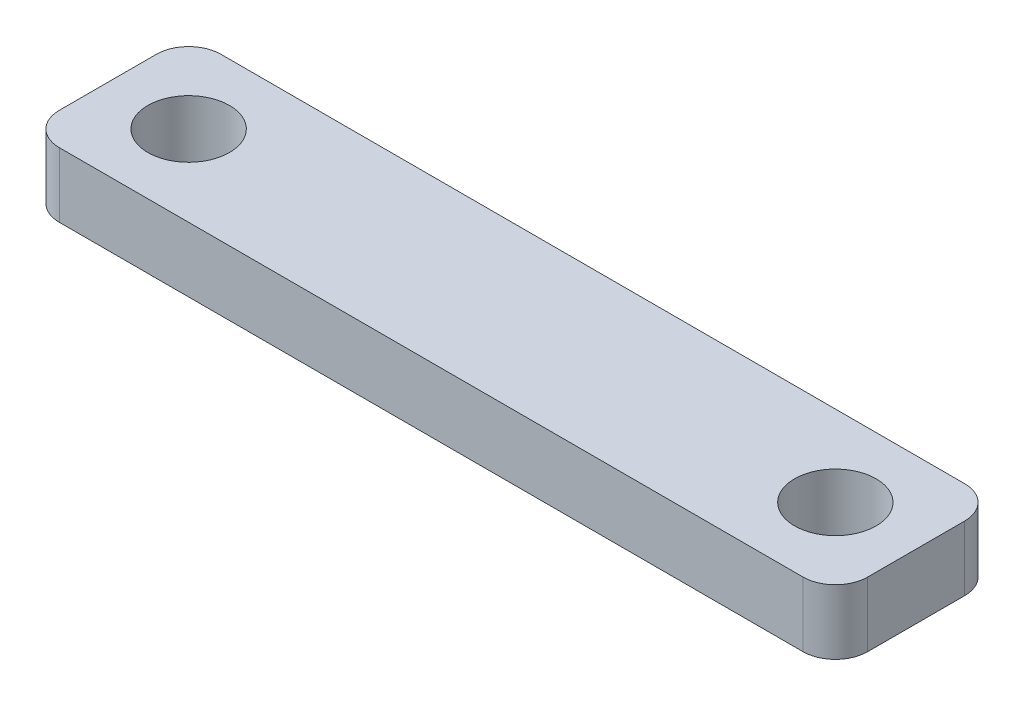
ISO-10303-21;
HEADER;
FILE_DESCRIPTION(('STEP AP214'),'2;1');
FILE_NAME('part.step','',(''),(''),'','','');
FILE_SCHEMA(('AUTOMOTIVE_DESIGN { 1 0 10303 214 1 1 1 1 }'));
ENDSEC;
DATA;
#1=APPLICATION_CONTEXT('core data for automotive mechanical design processes');
#2=APPLICATION_PROTOCOL_DEFINITION('international standard','automotive_design',2000,#1);
#3=PRODUCT_CONTEXT('',#1,'mechanical');
#4=PRODUCT('Part','Part','',(#3));
#5=PRODUCT_RELATED_PRODUCT_CATEGORY('part','',(#4));
#6=PRODUCT_DEFINITION_FORMATION('','',#4);
#7=PRODUCT_DEFINITION_CONTEXT('part definition',#1,'design');
#8=PRODUCT_DEFINITION('design','',#6,#7);
#9=PRODUCT_DEFINITION_SHAPE('','',#8);
#10=(LENGTH_UNIT() NAMED_UNIT(*) SI_UNIT(.MILLI.,.METRE.));
#11=(NAMED_UNIT(*) PLANE_ANGLE_UNIT() SI_UNIT($,.RADIAN.));
#12=(NAMED_UNIT(*) SI_UNIT($,.STERADIAN.) SOLID_ANGLE_UNIT());
#13=UNCERTAINTY_MEASURE_WITH_UNIT(LENGTH_MEASURE(1.E-05),#10,'distance_accuracy_value','');
#14=(GEOMETRIC_REPRESENTATION_CONTEXT(3) GLOBAL_UNCERTAINTY_ASSIGNED_CONTEXT((#13)) GLOBAL_UNIT_ASSIGNED_CONTEXT((#10,
#11,#12)) REPRESENTATION_CONTEXT('',''));
#15=CARTESIAN_POINT('',(0.,0.,0.));
#16=DIRECTION('',(0.,0.,1.));
#17=DIRECTION('',(1.,0.,0.));
#18=AXIS2_PLACEMENT_3D('',#15,#16,#17);
#19=CARTESIAN_POINT('',(0.,4.,0.));
#20=DIRECTION('',(0.,-1.,0.));
#21=DIRECTION('',(0.,0.,1.));
#22=AXIS2_PLACEMENT_3D('',#19,#20,#21);
#23=PLANE('',#22);
#24=DIRECTION('',(0.,0.,1.));
#25=VECTOR('',#24,1.);
#26=CARTESIAN_POINT('',(5.,4.,-5.));
#27=LINE('',#26,#25);
#28=CARTESIAN_POINT('',(5.,4.,-3.));
#29=VERTEX_POINT('',#28);
#30=CARTESIAN_POINT('',(5.,4.,3.));
#31=VERTEX_POINT('',#30);
#32=EDGE_CURVE('E175',#29,#31,#27,.T.);
#33=ORIENTED_EDGE('',*,*,#32,.F.);
#34=CARTESIAN_POINT('',(3.,4.,-3.));
#35=DIRECTION('',(0.,1.,0.));
#36=DIRECTION('',(0.,0.,1.));
#37=AXIS2_PLACEMENT_3D('',#34,#35,#36);
#38=CIRCLE('',#37,2.);
#39=CARTESIAN_POINT('',(2.99999999999999,4.,-5.));
#40=VERTEX_POINT('',#39);
#41=EDGE_CURVE('E154',#40,#29,#38,.F.);
#42=ORIENTED_EDGE('',*,*,#41,.F.);
#43=DIRECTION('',(1.,0.,0.));
#44=VECTOR('',#43,1.);
#45=CARTESIAN_POINT('',(-45.,4.,-5.));
#46=LINE('',#45,#44);
#47=CARTESIAN_POINT('',(-43.,4.,-5.));
#48=VERTEX_POINT('',#47);
#49=EDGE_CURVE('E133',#48,#40,#46,.T.);
#50=ORIENTED_EDGE('',*,*,#49,.F.);
#51=CARTESIAN_POINT('',(-43.,4.,-3.));
#52=DIRECTION('',(0.,1.,0.));
#53=DIRECTION('',(0.,0.,1.));
#54=AXIS2_PLACEMENT_3D('',#51,#52,#53);
#55=CIRCLE('',#54,2.);
#56=CARTESIAN_POINT('',(-45.,4.,-3.));
#57=VERTEX_POINT('',#56);
#58=EDGE_CURVE('E152',#57,#48,#55,.F.);
#59=ORIENTED_EDGE('',*,*,#58,.F.);
#60=DIRECTION('',(0.,0.,-1.));
#61=VECTOR('',#60,1.);
#62=CARTESIAN_POINT('',(-45.,4.,-5.));
#63=LINE('',#62,#61);
#64=CARTESIAN_POINT('',(-45.,4.,3.));
#65=VERTEX_POINT('',#64);
#66=EDGE_CURVE('E130',#65,#57,#63,.T.);
#67=ORIENTED_EDGE('',*,*,#66,.F.);
#68=CARTESIAN_POINT('',(-43.,4.,3.));
#69=DIRECTION('',(0.,1.,0.));
#70=DIRECTION('',(0.,0.,1.));
#71=AXIS2_PLACEMENT_3D('',#68,#69,#70);
#72=CIRCLE('',#71,2.);
#73=CARTESIAN_POINT('',(-43.,4.,5.));
#74=VERTEX_POINT('',#73);
#75=EDGE_CURVE('E149',#74,#65,#72,.F.);
#76=ORIENTED_EDGE('',*,*,#75,.F.);
#77=DIRECTION('',(-1.,0.,0.));
#78=VECTOR('',#77,1.);
#79=CARTESIAN_POINT('',(-45.,4.,5.));
#80=LINE('',#79,#78);
#81=CARTESIAN_POINT('',(2.99999999999999,4.,5.));
#82=VERTEX_POINT('',#81);
#83=EDGE_CURVE('E139',#82,#74,#80,.T.);
#84=ORIENTED_EDGE('',*,*,#83,.F.);
#85=CARTESIAN_POINT('',(3.,4.,3.));
#86=DIRECTION('',(0.,1.,0.));
#87=DIRECTION('',(0.,0.,1.));
#88=AXIS2_PLACEMENT_3D('',#85,#86,#87);
#89=CIRCLE('',#88,2.);
#90=EDGE_CURVE('E108',#31,#82,#89,.F.);
#91=ORIENTED_EDGE('',*,*,#90,.F.);
#92=EDGE_LOOP('',(#33,#42,#50,#59,#67,#76,#84,#91));
#93=FACE_BOUND('',#92,.T.);
#94=CARTESIAN_POINT('',(0.,4.,0.));
#95=DIRECTION('',(0.,-1.,0.));
#96=DIRECTION('',(0.,0.,-1.));
#97=AXIS2_PLACEMENT_3D('',#94,#95,#96);
#98=CIRCLE('',#97,2.525);
#99=CARTESIAN_POINT('',(0.,4.,-2.525));
#100=VERTEX_POINT('',#99);
#101=EDGE_CURVE('E167',#100,#100,#98,.T.);
#102=ORIENTED_EDGE('',*,*,#101,.T.);
#103=EDGE_LOOP('',(#102));
#104=FACE_BOUND('',#103,.T.);
#105=CARTESIAN_POINT('',(-40.,4.,0.));
#106=DIRECTION('',(0.,-1.,0.));
#107=DIRECTION('',(0.,0.,-1.));
#108=AXIS2_PLACEMENT_3D('',#105,#106,#107);
#109=CIRCLE('',#108,2.525);
#110=CARTESIAN_POINT('',(-40.,4.,-2.525));
#111=VERTEX_POINT('',#110);
#112=EDGE_CURVE('E180',#111,#111,#109,.T.);
#113=ORIENTED_EDGE('',*,*,#112,.T.);
#114=EDGE_LOOP('',(#113));
#115=FACE_BOUND('',#114,.T.);
#116=ADVANCED_FACE('F37',(#93,#104,#115),#23,.F.);
#117=CARTESIAN_POINT('',(0.,0.,0.));
#118=DIRECTION('',(0.,-1.,0.));
#119=DIRECTION('',(0.,0.,1.));
#120=AXIS2_PLACEMENT_3D('',#117,#118,#119);
#121=PLANE('',#120);
#122=CARTESIAN_POINT('',(0.,0.,0.));
#123=DIRECTION('',(0.,-1.,0.));
#124=DIRECTION('',(0.,0.,-1.));
#125=AXIS2_PLACEMENT_3D('',#122,#123,#124);
#126=CIRCLE('',#125,2.525);
#127=CARTESIAN_POINT('',(0.,0.,-2.525));
#128=VERTEX_POINT('',#127);
#129=EDGE_CURVE('E171',#128,#128,#126,.T.);
#130=ORIENTED_EDGE('',*,*,#129,.F.);
#131=EDGE_LOOP('',(#130));
#132=FACE_BOUND('',#131,.T.);
#133=DIRECTION('',(-1.,0.,0.));
#134=VECTOR('',#133,1.);
#135=CARTESIAN_POINT('',(-45.,0.,5.));
#136=LINE('',#135,#134);
#137=CARTESIAN_POINT('',(2.99999999999999,0.,5.));
#138=VERTEX_POINT('',#137);
#139=CARTESIAN_POINT('',(-43.,0.,5.));
#140=VERTEX_POINT('',#139);
#141=EDGE_CURVE('E121',#138,#140,#136,.T.);
#142=ORIENTED_EDGE('',*,*,#141,.T.);
#143=CARTESIAN_POINT('',(-43.,0.,3.));
#144=DIRECTION('',(0.,1.,0.));
#145=DIRECTION('',(0.,0.,1.));
#146=AXIS2_PLACEMENT_3D('',#143,#144,#145);
#147=CIRCLE('',#146,2.);
#148=CARTESIAN_POINT('',(-45.,0.,3.));
#149=VERTEX_POINT('',#148);
#150=EDGE_CURVE('E113',#149,#140,#147,.T.);
#151=ORIENTED_EDGE('',*,*,#150,.F.);
#152=DIRECTION('',(0.,0.,-1.));
#153=VECTOR('',#152,1.);
#154=CARTESIAN_POINT('',(-45.,0.,-5.));
#155=LINE('',#154,#153);
#156=CARTESIAN_POINT('',(-45.,0.,-3.));
#157=VERTEX_POINT('',#156);
#158=EDGE_CURVE('E164',#149,#157,#155,.T.);
#159=ORIENTED_EDGE('',*,*,#158,.T.);
#160=CARTESIAN_POINT('',(-43.,0.,-3.));
#161=DIRECTION('',(0.,1.,0.));
#162=DIRECTION('',(0.,0.,1.));
#163=AXIS2_PLACEMENT_3D('',#160,#161,#162);
#164=CIRCLE('',#163,2.);
#165=CARTESIAN_POINT('',(-43.,0.,-5.));
#166=VERTEX_POINT('',#165);
#167=EDGE_CURVE('E142',#166,#157,#164,.T.);
#168=ORIENTED_EDGE('',*,*,#167,.F.);
#169=DIRECTION('',(1.,0.,0.));
#170=VECTOR('',#169,1.);
#171=CARTESIAN_POINT('',(-45.,0.,-5.));
#172=LINE('',#171,#170);
#173=CARTESIAN_POINT('',(2.99999999999999,0.,-5.));
#174=VERTEX_POINT('',#173);
#175=EDGE_CURVE('E135',#166,#174,#172,.T.);
#176=ORIENTED_EDGE('',*,*,#175,.T.);
#177=CARTESIAN_POINT('',(3.,0.,-3.));
#178=DIRECTION('',(0.,1.,0.));
#179=DIRECTION('',(0.,0.,1.));
#180=AXIS2_PLACEMENT_3D('',#177,#178,#179);
#181=CIRCLE('',#180,2.);
#182=CARTESIAN_POINT('',(5.,0.,-3.));
#183=VERTEX_POINT('',#182);
#184=EDGE_CURVE('E126',#183,#174,#181,.T.);
#185=ORIENTED_EDGE('',*,*,#184,.F.);
#186=DIRECTION('',(0.,0.,1.));
#187=VECTOR('',#186,1.);
#188=CARTESIAN_POINT('',(5.,0.,-5.));
#189=LINE('',#188,#187);
#190=CARTESIAN_POINT('',(5.,0.,3.));
#191=VERTEX_POINT('',#190);
#192=EDGE_CURVE('E124',#183,#191,#189,.T.);
#193=ORIENTED_EDGE('',*,*,#192,.T.);
#194=CARTESIAN_POINT('',(3.,0.,3.));
#195=DIRECTION('',(0.,1.,0.));
#196=DIRECTION('',(0.,0.,1.));
#197=AXIS2_PLACEMENT_3D('',#194,#195,#196);
#198=CIRCLE('',#197,2.);
#199=EDGE_CURVE('E105',#138,#191,#198,.T.);
#200=ORIENTED_EDGE('',*,*,#199,.F.);
#201=EDGE_LOOP('',(#142,#151,#159,#168,#176,#185,#193,#200));
#202=FACE_BOUND('',#201,.T.);
#203=CARTESIAN_POINT('',(-40.,0.,0.));
#204=DIRECTION('',(0.,-1.,0.));
#205=DIRECTION('',(0.,0.,-1.));
#206=AXIS2_PLACEMENT_3D('',#203,#204,#205);
#207=CIRCLE('',#206,2.525);
#208=CARTESIAN_POINT('',(-40.,0.,-2.525));
#209=VERTEX_POINT('',#208);
#210=EDGE_CURVE('E182',#209,#209,#207,.T.);
#211=ORIENTED_EDGE('',*,*,#210,.F.);
#212=EDGE_LOOP('',(#211));
#213=FACE_BOUND('',#212,.T.);
#214=ADVANCED_FACE('F118',(#132,#202,#213),#121,.T.);
#215=CARTESIAN_POINT('',(-45.,4.,-5.));
#216=DIRECTION('',(1.,0.,0.));
#217=DIRECTION('',(0.,0.,1.));
#218=AXIS2_PLACEMENT_3D('',#215,#216,#217);
#219=PLANE('',#218);
#220=ORIENTED_EDGE('',*,*,#158,.F.);
#221=DIRECTION('',(0.,-1.,0.));
#222=VECTOR('',#221,1.);
#223=CARTESIAN_POINT('',(-45.,4.,3.));
#224=LINE('',#223,#222);
#225=EDGE_CURVE('E45',#65,#149,#224,.T.);
#226=ORIENTED_EDGE('',*,*,#225,.F.);
#227=ORIENTED_EDGE('',*,*,#66,.T.);
#228=DIRECTION('',(0.,-1.,0.));
#229=VECTOR('',#228,1.);
#230=CARTESIAN_POINT('',(-45.,4.,-3.));
#231=LINE('',#230,#229);
#232=EDGE_CURVE('E11',#157,#57,#231,.F.);
#233=ORIENTED_EDGE('',*,*,#232,.F.);
#234=EDGE_LOOP('',(#220,#226,#227,#233));
#235=FACE_BOUND('',#234,.T.);
#236=ADVANCED_FACE('F165',(#235),#219,.F.);
#237=CARTESIAN_POINT('',(-45.,4.,-5.));
#238=DIRECTION('',(0.,0.,1.));
#239=DIRECTION('',(-1.,0.,0.));
#240=AXIS2_PLACEMENT_3D('',#237,#238,#239);
#241=PLANE('',#240);
#242=ORIENTED_EDGE('',*,*,#175,.F.);
#243=DIRECTION('',(0.,-1.,0.));
#244=VECTOR('',#243,1.);
#245=CARTESIAN_POINT('',(-43.,4.,-5.));
#246=LINE('',#245,#244);
#247=EDGE_CURVE('E59',#48,#166,#246,.T.);
#248=ORIENTED_EDGE('',*,*,#247,.F.);
#249=ORIENTED_EDGE('',*,*,#49,.T.);
#250=DIRECTION('',(0.,-1.,0.));
#251=VECTOR('',#250,1.);
#252=CARTESIAN_POINT('',(3.,4.,-5.));
#253=LINE('',#252,#251);
#254=EDGE_CURVE('E52',#174,#40,#253,.F.);
#255=ORIENTED_EDGE('',*,*,#254,.F.);
#256=EDGE_LOOP('',(#242,#248,#249,#255));
#257=FACE_BOUND('',#256,.T.);
#258=ADVANCED_FACE('F202',(#257),#241,.F.);
#259=CARTESIAN_POINT('',(5.,4.,-5.));
#260=DIRECTION('',(-1.,0.,0.));
#261=DIRECTION('',(0.,0.,-1.));
#262=AXIS2_PLACEMENT_3D('',#259,#260,#261);
#263=PLANE('',#262);
#264=ORIENTED_EDGE('',*,*,#192,.F.);
#265=DIRECTION('',(0.,-1.,0.));
#266=VECTOR('',#265,1.);
#267=CARTESIAN_POINT('',(5.,4.,-3.));
#268=LINE('',#267,#266);
#269=EDGE_CURVE('E125',#29,#183,#268,.T.);
#270=ORIENTED_EDGE('',*,*,#269,.F.);
#271=ORIENTED_EDGE('',*,*,#32,.T.);
#272=DIRECTION('',(0.,-1.,0.));
#273=VECTOR('',#272,1.);
#274=CARTESIAN_POINT('',(5.,4.,3.));
#275=LINE('',#274,#273);
#276=EDGE_CURVE('E147',#191,#31,#275,.F.);
#277=ORIENTED_EDGE('',*,*,#276,.F.);
#278=EDGE_LOOP('',(#264,#270,#271,#277));
#279=FACE_BOUND('',#278,.T.);
#280=ADVANCED_FACE('F211',(#279),#263,.F.);
#281=CARTESIAN_POINT('',(-45.,4.,5.));
#282=DIRECTION('',(0.,0.,-1.));
#283=DIRECTION('',(1.,0.,0.));
#284=AXIS2_PLACEMENT_3D('',#281,#282,#283);
#285=PLANE('',#284);
#286=ORIENTED_EDGE('',*,*,#83,.T.);
#287=DIRECTION('',(0.,-1.,0.));
#288=VECTOR('',#287,1.);
#289=CARTESIAN_POINT('',(-43.,4.,5.));
#290=LINE('',#289,#288);
#291=EDGE_CURVE('E114',#140,#74,#290,.F.);
#292=ORIENTED_EDGE('',*,*,#291,.F.);
#293=ORIENTED_EDGE('',*,*,#141,.F.);
#294=DIRECTION('',(0.,-1.,0.));
#295=VECTOR('',#294,1.);
#296=CARTESIAN_POINT('',(3.,4.,5.));
#297=LINE('',#296,#295);
#298=EDGE_CURVE('E102',#82,#138,#297,.T.);
#299=ORIENTED_EDGE('',*,*,#298,.F.);
#300=EDGE_LOOP('',(#286,#292,#293,#299));
#301=FACE_BOUND('',#300,.T.);
#302=ADVANCED_FACE('F128',(#301),#285,.F.);
#303=CARTESIAN_POINT('',(0.,4.,0.));
#304=DIRECTION('',(0.,-1.,0.));
#305=DIRECTION('',(0.,0.,1.));
#306=AXIS2_PLACEMENT_3D('',#303,#304,#305);
#307=CYLINDRICAL_SURFACE('',#306,2.525);
#308=ORIENTED_EDGE('',*,*,#101,.F.);
#309=EDGE_LOOP('',(#308));
#310=FACE_BOUND('',#309,.T.);
#311=ORIENTED_EDGE('',*,*,#129,.T.);
#312=EDGE_LOOP('',(#311));
#313=FACE_BOUND('',#312,.T.);
#314=ADVANCED_FACE('F192',(#310,#313),#307,.F.);
#315=CARTESIAN_POINT('',(-40.,4.,0.));
#316=DIRECTION('',(0.,-1.,0.));
#317=DIRECTION('',(0.,0.,1.));
#318=AXIS2_PLACEMENT_3D('',#315,#316,#317);
#319=CYLINDRICAL_SURFACE('',#318,2.525);
#320=ORIENTED_EDGE('',*,*,#112,.F.);
#321=EDGE_LOOP('',(#320));
#322=FACE_BOUND('',#321,.T.);
#323=ORIENTED_EDGE('',*,*,#210,.T.);
#324=EDGE_LOOP('',(#323));
#325=FACE_BOUND('',#324,.T.);
#326=ADVANCED_FACE('F189',(#322,#325),#319,.F.);
#327=CARTESIAN_POINT('',(3.,4.,3.));
#328=DIRECTION('',(0.,-1.,0.));
#329=DIRECTION('',(0.,0.,1.));
#330=AXIS2_PLACEMENT_3D('',#327,#328,#329);
#331=CYLINDRICAL_SURFACE('',#330,2.);
#332=ORIENTED_EDGE('',*,*,#90,.T.);
#333=ORIENTED_EDGE('',*,*,#298,.T.);
#334=ORIENTED_EDGE('',*,*,#199,.T.);
#335=ORIENTED_EDGE('',*,*,#276,.T.);
#336=EDGE_LOOP('',(#332,#333,#334,#335));
#337=FACE_BOUND('',#336,.T.);
#338=ADVANCED_FACE('F104',(#337),#331,.T.);
#339=CARTESIAN_POINT('',(3.,4.,-3.));
#340=DIRECTION('',(0.,-1.,0.));
#341=DIRECTION('',(0.,0.,1.));
#342=AXIS2_PLACEMENT_3D('',#339,#340,#341);
#343=CYLINDRICAL_SURFACE('',#342,2.);
#344=ORIENTED_EDGE('',*,*,#41,.T.);
#345=ORIENTED_EDGE('',*,*,#269,.T.);
#346=ORIENTED_EDGE('',*,*,#184,.T.);
#347=ORIENTED_EDGE('',*,*,#254,.T.);
#348=EDGE_LOOP('',(#344,#345,#346,#347));
#349=FACE_BOUND('',#348,.T.);
#350=ADVANCED_FACE('F219',(#349),#343,.T.);
#351=CARTESIAN_POINT('',(-43.,4.,-3.));
#352=DIRECTION('',(0.,-1.,0.));
#353=DIRECTION('',(0.,0.,1.));
#354=AXIS2_PLACEMENT_3D('',#351,#352,#353);
#355=CYLINDRICAL_SURFACE('',#354,2.);
#356=ORIENTED_EDGE('',*,*,#58,.T.);
#357=ORIENTED_EDGE('',*,*,#247,.T.);
#358=ORIENTED_EDGE('',*,*,#167,.T.);
#359=ORIENTED_EDGE('',*,*,#232,.T.);
#360=EDGE_LOOP('',(#356,#357,#358,#359));
#361=FACE_BOUND('',#360,.T.);
#362=ADVANCED_FACE('F221',(#361),#355,.T.);
#363=CARTESIAN_POINT('',(-43.,4.,3.));
#364=DIRECTION('',(0.,-1.,0.));
#365=DIRECTION('',(0.,0.,1.));
#366=AXIS2_PLACEMENT_3D('',#363,#364,#365);
#367=CYLINDRICAL_SURFACE('',#366,2.);
#368=ORIENTED_EDGE('',*,*,#75,.T.);
#369=ORIENTED_EDGE('',*,*,#225,.T.);
#370=ORIENTED_EDGE('',*,*,#150,.T.);
#371=ORIENTED_EDGE('',*,*,#291,.T.);
#372=EDGE_LOOP('',(#368,#369,#370,#371));
#373=FACE_BOUND('',#372,.T.);
#374=ADVANCED_FACE('F39',(#373),#367,.T.);
#375=CLOSED_SHELL('',(#116,#214,#236,#258,#280,#302,#314,#326,#338,#350,#362,#374));
#376=MANIFOLD_SOLID_BREP('B2',#375);
#377=ADVANCED_BREP_SHAPE_REPRESENTATION('',(#18,#376),#14);
#378=SHAPE_DEFINITION_REPRESENTATION(#9,#377);
ENDSEC;
END-ISO-10303-21;
